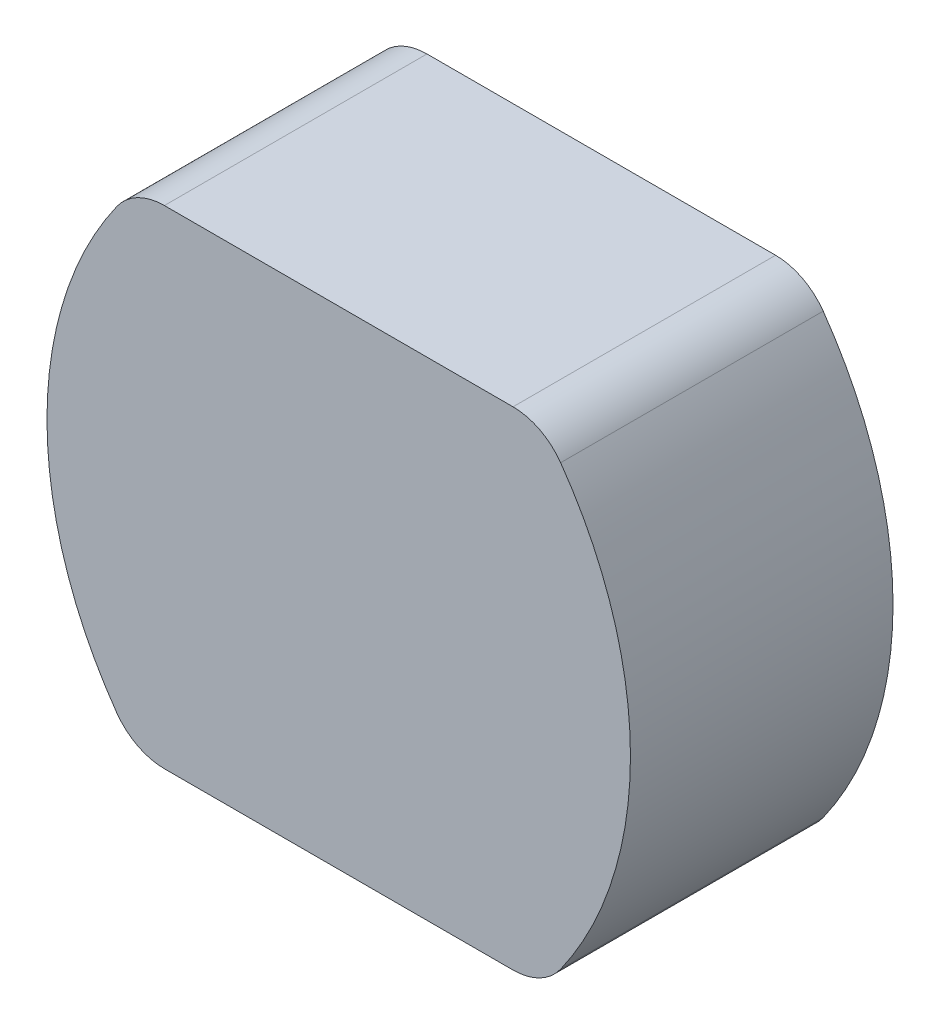
ISO-10303-21;
HEADER;
FILE_DESCRIPTION(('STEP AP214'),'2;1');
FILE_NAME('part.step','',(''),(''),'','','');
FILE_SCHEMA(('AUTOMOTIVE_DESIGN { 1 0 10303 214 1 1 1 1 }'));
ENDSEC;
DATA;
#1=APPLICATION_CONTEXT('core data for automotive mechanical design processes');
#2=APPLICATION_PROTOCOL_DEFINITION('international standard','automotive_design',2000,#1);
#3=PRODUCT_CONTEXT('',#1,'mechanical');
#4=PRODUCT('Part','Part','',(#3));
#5=PRODUCT_RELATED_PRODUCT_CATEGORY('part','',(#4));
#6=PRODUCT_DEFINITION_FORMATION('','',#4);
#7=PRODUCT_DEFINITION_CONTEXT('part definition',#1,'design');
#8=PRODUCT_DEFINITION('design','',#6,#7);
#9=PRODUCT_DEFINITION_SHAPE('','',#8);
#10=(LENGTH_UNIT() NAMED_UNIT(*) SI_UNIT(.MILLI.,.METRE.));
#11=(NAMED_UNIT(*) PLANE_ANGLE_UNIT() SI_UNIT($,.RADIAN.));
#12=(NAMED_UNIT(*) SI_UNIT($,.STERADIAN.) SOLID_ANGLE_UNIT());
#13=UNCERTAINTY_MEASURE_WITH_UNIT(LENGTH_MEASURE(1.E-05),#10,'distance_accuracy_value','');
#14=(GEOMETRIC_REPRESENTATION_CONTEXT(3) GLOBAL_UNCERTAINTY_ASSIGNED_CONTEXT((#13)) GLOBAL_UNIT_ASSIGNED_CONTEXT((#10,
#11,#12)) REPRESENTATION_CONTEXT('',''));
#15=CARTESIAN_POINT('',(0.,0.,0.));
#16=DIRECTION('',(0.,0.,1.));
#17=DIRECTION('',(1.,0.,0.));
#18=AXIS2_PLACEMENT_3D('',#15,#16,#17);
#19=CARTESIAN_POINT('',(3.,0.,9.));
#20=DIRECTION('',(0.,0.,-1.));
#21=DIRECTION('',(-1.,0.,0.));
#22=AXIS2_PLACEMENT_3D('',#19,#20,#21);
#23=CYLINDRICAL_SURFACE('',#22,13.);
#24=CARTESIAN_POINT('',(3.,0.,0.));
#25=DIRECTION('',(0.,0.,1.));
#26=DIRECTION('',(1.,0.,0.));
#27=AXIS2_PLACEMENT_3D('',#24,#25,#26);
#28=CIRCLE('',#27,13.);
#29=CARTESIAN_POINT('',(-7.6068033679309,-7.51636363636364,0.));
#30=VERTEX_POINT('',#29);
#31=CARTESIAN_POINT('',(-7.60680336793091,7.51636363636363,0.));
#32=VERTEX_POINT('',#31);
#33=EDGE_CURVE('E106',#30,#32,#28,.F.);
#34=ORIENTED_EDGE('',*,*,#33,.F.);
#35=DIRECTION('',(0.,0.,-1.));
#36=VECTOR('',#35,1.);
#37=CARTESIAN_POINT('',(-7.6068033679309,-7.51636363636364,9.));
#38=LINE('',#37,#36);
#39=CARTESIAN_POINT('',(-7.6068033679309,-7.51636363636364,9.));
#40=VERTEX_POINT('',#39);
#41=EDGE_CURVE('E56',#30,#40,#38,.F.);
#42=ORIENTED_EDGE('',*,*,#41,.T.);
#43=CARTESIAN_POINT('',(3.,0.,9.));
#44=DIRECTION('',(0.,0.,1.));
#45=DIRECTION('',(1.,0.,0.));
#46=AXIS2_PLACEMENT_3D('',#43,#44,#45);
#47=CIRCLE('',#46,13.);
#48=CARTESIAN_POINT('',(-7.60680336793091,7.51636363636363,9.));
#49=VERTEX_POINT('',#48);
#50=EDGE_CURVE('E121',#40,#49,#47,.F.);
#51=ORIENTED_EDGE('',*,*,#50,.T.);
#52=DIRECTION('',(0.,0.,-1.));
#53=VECTOR('',#52,1.);
#54=CARTESIAN_POINT('',(-7.60680336793091,7.51636363636363,9.));
#55=LINE('',#54,#53);
#56=EDGE_CURVE('E142',#49,#32,#55,.T.);
#57=ORIENTED_EDGE('',*,*,#56,.T.);
#58=EDGE_LOOP('',(#34,#42,#51,#57));
#59=FACE_BOUND('',#58,.T.);
#60=ADVANCED_FACE('F33',(#59),#23,.T.);
#61=CARTESIAN_POINT('',(0.,-8.36,9.));
#62=DIRECTION('',(0.,1.,0.));
#63=DIRECTION('',(-1.,0.,0.));
#64=AXIS2_PLACEMENT_3D('',#61,#62,#63);
#65=PLANE('',#64);
#66=DIRECTION('',(1.,0.,0.));
#67=VECTOR('',#66,1.);
#68=CARTESIAN_POINT('',(0.,-8.36,9.));
#69=LINE('',#68,#67);
#70=CARTESIAN_POINT('',(-5.9749874651723,-8.36,9.));
#71=VERTEX_POINT('',#70);
#72=CARTESIAN_POINT('',(5.97498746517231,-8.36,9.));
#73=VERTEX_POINT('',#72);
#74=EDGE_CURVE('E157',#71,#73,#69,.T.);
#75=ORIENTED_EDGE('',*,*,#74,.F.);
#76=DIRECTION('',(0.,0.,1.));
#77=VECTOR('',#76,1.);
#78=CARTESIAN_POINT('',(-5.9749874651723,-8.36,0.));
#79=LINE('',#78,#77);
#80=CARTESIAN_POINT('',(-5.9749874651723,-8.36,0.));
#81=VERTEX_POINT('',#80);
#82=EDGE_CURVE('E146',#71,#81,#79,.F.);
#83=ORIENTED_EDGE('',*,*,#82,.T.);
#84=DIRECTION('',(1.,0.,0.));
#85=VECTOR('',#84,1.);
#86=CARTESIAN_POINT('',(0.,-8.36,0.));
#87=LINE('',#86,#85);
#88=CARTESIAN_POINT('',(5.97498746517231,-8.36,0.));
#89=VERTEX_POINT('',#88);
#90=EDGE_CURVE('E166',#81,#89,#87,.T.);
#91=ORIENTED_EDGE('',*,*,#90,.T.);
#92=DIRECTION('',(0.,0.,-1.));
#93=VECTOR('',#92,1.);
#94=CARTESIAN_POINT('',(5.97498746517231,-8.36,9.));
#95=LINE('',#94,#93);
#96=EDGE_CURVE('E144',#89,#73,#95,.F.);
#97=ORIENTED_EDGE('',*,*,#96,.T.);
#98=EDGE_LOOP('',(#75,#83,#91,#97));
#99=FACE_BOUND('',#98,.T.);
#100=ADVANCED_FACE('F161',(#99),#65,.F.);
#101=CARTESIAN_POINT('',(-3.,0.,9.));
#102=DIRECTION('',(0.,0.,-1.));
#103=DIRECTION('',(-1.,0.,0.));
#104=AXIS2_PLACEMENT_3D('',#101,#102,#103);
#105=CYLINDRICAL_SURFACE('',#104,13.);
#106=CARTESIAN_POINT('',(-3.,0.,9.));
#107=DIRECTION('',(0.,0.,1.));
#108=DIRECTION('',(1.,0.,0.));
#109=AXIS2_PLACEMENT_3D('',#106,#107,#108);
#110=CIRCLE('',#109,13.);
#111=CARTESIAN_POINT('',(7.60680336793091,-7.51636363636364,9.));
#112=VERTEX_POINT('',#111);
#113=CARTESIAN_POINT('',(7.60680336793091,7.51636363636364,9.));
#114=VERTEX_POINT('',#113);
#115=EDGE_CURVE('E131',#112,#114,#110,.T.);
#116=ORIENTED_EDGE('',*,*,#115,.F.);
#117=DIRECTION('',(0.,0.,-1.));
#118=VECTOR('',#117,1.);
#119=CARTESIAN_POINT('',(7.60680336793091,-7.51636363636364,9.));
#120=LINE('',#119,#118);
#121=CARTESIAN_POINT('',(7.60680336793091,-7.51636363636364,0.));
#122=VERTEX_POINT('',#121);
#123=EDGE_CURVE('E11',#112,#122,#120,.T.);
#124=ORIENTED_EDGE('',*,*,#123,.T.);
#125=CARTESIAN_POINT('',(-3.,0.,0.));
#126=DIRECTION('',(0.,0.,1.));
#127=DIRECTION('',(1.,0.,0.));
#128=AXIS2_PLACEMENT_3D('',#125,#126,#127);
#129=CIRCLE('',#128,13.);
#130=CARTESIAN_POINT('',(7.60680336793091,7.51636363636364,0.));
#131=VERTEX_POINT('',#130);
#132=EDGE_CURVE('E122',#122,#131,#129,.T.);
#133=ORIENTED_EDGE('',*,*,#132,.T.);
#134=DIRECTION('',(0.,0.,-1.));
#135=VECTOR('',#134,1.);
#136=CARTESIAN_POINT('',(7.60680336793091,7.51636363636364,9.));
#137=LINE('',#136,#135);
#138=EDGE_CURVE('E136',#131,#114,#137,.F.);
#139=ORIENTED_EDGE('',*,*,#138,.T.);
#140=EDGE_LOOP('',(#116,#124,#133,#139));
#141=FACE_BOUND('',#140,.T.);
#142=ADVANCED_FACE('F172',(#141),#105,.T.);
#143=CARTESIAN_POINT('',(0.,8.36,9.));
#144=DIRECTION('',(0.,1.,0.));
#145=DIRECTION('',(-1.,0.,0.));
#146=AXIS2_PLACEMENT_3D('',#143,#144,#145);
#147=PLANE('',#146);
#148=DIRECTION('',(1.,0.,0.));
#149=VECTOR('',#148,1.);
#150=CARTESIAN_POINT('',(0.,8.36,9.));
#151=LINE('',#150,#149);
#152=CARTESIAN_POINT('',(-5.97498746517231,8.36,9.));
#153=VERTEX_POINT('',#152);
#154=CARTESIAN_POINT('',(5.97498746517231,8.36,9.));
#155=VERTEX_POINT('',#154);
#156=EDGE_CURVE('E128',#153,#155,#151,.T.);
#157=ORIENTED_EDGE('',*,*,#156,.T.);
#158=DIRECTION('',(0.,0.,1.));
#159=VECTOR('',#158,1.);
#160=CARTESIAN_POINT('',(5.97498746517231,8.36,0.));
#161=LINE('',#160,#159);
#162=CARTESIAN_POINT('',(5.97498746517231,8.36,0.));
#163=VERTEX_POINT('',#162);
#164=EDGE_CURVE('E112',#155,#163,#161,.F.);
#165=ORIENTED_EDGE('',*,*,#164,.T.);
#166=DIRECTION('',(1.,0.,0.));
#167=VECTOR('',#166,1.);
#168=CARTESIAN_POINT('',(0.,8.36,0.));
#169=LINE('',#168,#167);
#170=CARTESIAN_POINT('',(-5.97498746517231,8.36,0.));
#171=VERTEX_POINT('',#170);
#172=EDGE_CURVE('E105',#171,#163,#169,.T.);
#173=ORIENTED_EDGE('',*,*,#172,.F.);
#174=DIRECTION('',(0.,0.,-1.));
#175=VECTOR('',#174,1.);
#176=CARTESIAN_POINT('',(-5.97498746517231,8.36,9.));
#177=LINE('',#176,#175);
#178=EDGE_CURVE('E118',#171,#153,#177,.F.);
#179=ORIENTED_EDGE('',*,*,#178,.T.);
#180=EDGE_LOOP('',(#157,#165,#173,#179));
#181=FACE_BOUND('',#180,.T.);
#182=ADVANCED_FACE('F117',(#181),#147,.T.);
#183=CARTESIAN_POINT('',(0.,0.,9.));
#184=DIRECTION('',(0.,0.,1.));
#185=DIRECTION('',(1.,0.,0.));
#186=AXIS2_PLACEMENT_3D('',#183,#184,#185);
#187=PLANE('',#186);
#188=ORIENTED_EDGE('',*,*,#50,.F.);
#189=CARTESIAN_POINT('',(-5.9749874651723,-6.36,9.));
#190=DIRECTION('',(0.,0.,1.));
#191=DIRECTION('',(1.,0.,0.));
#192=AXIS2_PLACEMENT_3D('',#189,#190,#191);
#193=CIRCLE('',#192,2.);
#194=EDGE_CURVE('E41',#40,#71,#193,.T.);
#195=ORIENTED_EDGE('',*,*,#194,.T.);
#196=ORIENTED_EDGE('',*,*,#74,.T.);
#197=CARTESIAN_POINT('',(5.97498746517231,-6.36,9.));
#198=DIRECTION('',(0.,0.,1.));
#199=DIRECTION('',(1.,0.,0.));
#200=AXIS2_PLACEMENT_3D('',#197,#198,#199);
#201=CIRCLE('',#200,2.);
#202=EDGE_CURVE('E48',#73,#112,#201,.T.);
#203=ORIENTED_EDGE('',*,*,#202,.T.);
#204=ORIENTED_EDGE('',*,*,#115,.T.);
#205=CARTESIAN_POINT('',(5.97498746517231,6.36,9.));
#206=DIRECTION('',(0.,0.,1.));
#207=DIRECTION('',(1.,0.,0.));
#208=AXIS2_PLACEMENT_3D('',#205,#206,#207);
#209=CIRCLE('',#208,2.);
#210=EDGE_CURVE('E140',#114,#155,#209,.T.);
#211=ORIENTED_EDGE('',*,*,#210,.T.);
#212=ORIENTED_EDGE('',*,*,#156,.F.);
#213=CARTESIAN_POINT('',(-5.97498746517231,6.36,9.));
#214=DIRECTION('',(0.,0.,1.));
#215=DIRECTION('',(1.,0.,0.));
#216=AXIS2_PLACEMENT_3D('',#213,#214,#215);
#217=CIRCLE('',#216,2.);
#218=EDGE_CURVE('E127',#153,#49,#217,.T.);
#219=ORIENTED_EDGE('',*,*,#218,.T.);
#220=EDGE_LOOP('',(#188,#195,#196,#203,#204,#211,#212,#219));
#221=FACE_BOUND('',#220,.T.);
#222=ADVANCED_FACE('F156',(#221),#187,.T.);
#223=CARTESIAN_POINT('',(0.,0.,0.));
#224=DIRECTION('',(0.,0.,1.));
#225=DIRECTION('',(1.,0.,0.));
#226=AXIS2_PLACEMENT_3D('',#223,#224,#225);
#227=PLANE('',#226);
#228=ORIENTED_EDGE('',*,*,#90,.F.);
#229=CARTESIAN_POINT('',(-5.9749874651723,-6.36,0.));
#230=DIRECTION('',(0.,0.,1.));
#231=DIRECTION('',(1.,0.,0.));
#232=AXIS2_PLACEMENT_3D('',#229,#230,#231);
#233=CIRCLE('',#232,2.);
#234=EDGE_CURVE('E151',#81,#30,#233,.F.);
#235=ORIENTED_EDGE('',*,*,#234,.T.);
#236=ORIENTED_EDGE('',*,*,#33,.T.);
#237=CARTESIAN_POINT('',(-5.97498746517231,6.36,0.));
#238=DIRECTION('',(0.,0.,1.));
#239=DIRECTION('',(1.,0.,0.));
#240=AXIS2_PLACEMENT_3D('',#237,#238,#239);
#241=CIRCLE('',#240,2.);
#242=EDGE_CURVE('E100',#32,#171,#241,.F.);
#243=ORIENTED_EDGE('',*,*,#242,.T.);
#244=ORIENTED_EDGE('',*,*,#172,.T.);
#245=CARTESIAN_POINT('',(5.97498746517231,6.36,0.));
#246=DIRECTION('',(0.,0.,1.));
#247=DIRECTION('',(1.,0.,0.));
#248=AXIS2_PLACEMENT_3D('',#245,#246,#247);
#249=CIRCLE('',#248,2.);
#250=EDGE_CURVE('E111',#163,#131,#249,.F.);
#251=ORIENTED_EDGE('',*,*,#250,.T.);
#252=ORIENTED_EDGE('',*,*,#132,.F.);
#253=CARTESIAN_POINT('',(5.97498746517231,-6.36,0.));
#254=DIRECTION('',(0.,0.,1.));
#255=DIRECTION('',(1.,0.,0.));
#256=AXIS2_PLACEMENT_3D('',#253,#254,#255);
#257=CIRCLE('',#256,2.);
#258=EDGE_CURVE('E149',#122,#89,#257,.F.);
#259=ORIENTED_EDGE('',*,*,#258,.T.);
#260=EDGE_LOOP('',(#228,#235,#236,#243,#244,#251,#252,#259));
#261=FACE_BOUND('',#260,.T.);
#262=ADVANCED_FACE('F103',(#261),#227,.F.);
#263=CARTESIAN_POINT('',(5.97498746517231,6.36,9.));
#264=DIRECTION('',(0.,0.,-1.));
#265=DIRECTION('',(-1.,0.,0.));
#266=AXIS2_PLACEMENT_3D('',#263,#264,#265);
#267=CYLINDRICAL_SURFACE('',#266,2.);
#268=ORIENTED_EDGE('',*,*,#210,.F.);
#269=ORIENTED_EDGE('',*,*,#138,.F.);
#270=ORIENTED_EDGE('',*,*,#250,.F.);
#271=ORIENTED_EDGE('',*,*,#164,.F.);
#272=EDGE_LOOP('',(#268,#269,#270,#271));
#273=FACE_BOUND('',#272,.T.);
#274=ADVANCED_FACE('F177',(#273),#267,.T.);
#275=CARTESIAN_POINT('',(-5.97498746517231,6.36,9.));
#276=DIRECTION('',(0.,0.,-1.));
#277=DIRECTION('',(-1.,0.,0.));
#278=AXIS2_PLACEMENT_3D('',#275,#276,#277);
#279=CYLINDRICAL_SURFACE('',#278,2.);
#280=ORIENTED_EDGE('',*,*,#218,.F.);
#281=ORIENTED_EDGE('',*,*,#178,.F.);
#282=ORIENTED_EDGE('',*,*,#242,.F.);
#283=ORIENTED_EDGE('',*,*,#56,.F.);
#284=EDGE_LOOP('',(#280,#281,#282,#283));
#285=FACE_BOUND('',#284,.T.);
#286=ADVANCED_FACE('F125',(#285),#279,.T.);
#287=CARTESIAN_POINT('',(-5.9749874651723,-6.36,9.));
#288=DIRECTION('',(0.,0.,-1.));
#289=DIRECTION('',(-1.,0.,0.));
#290=AXIS2_PLACEMENT_3D('',#287,#288,#289);
#291=CYLINDRICAL_SURFACE('',#290,2.);
#292=ORIENTED_EDGE('',*,*,#194,.F.);
#293=ORIENTED_EDGE('',*,*,#41,.F.);
#294=ORIENTED_EDGE('',*,*,#234,.F.);
#295=ORIENTED_EDGE('',*,*,#82,.F.);
#296=EDGE_LOOP('',(#292,#293,#294,#295));
#297=FACE_BOUND('',#296,.T.);
#298=ADVANCED_FACE('F165',(#297),#291,.T.);
#299=CARTESIAN_POINT('',(5.97498746517231,-6.36,9.));
#300=DIRECTION('',(0.,0.,-1.));
#301=DIRECTION('',(-1.,0.,0.));
#302=AXIS2_PLACEMENT_3D('',#299,#300,#301);
#303=CYLINDRICAL_SURFACE('',#302,2.);
#304=ORIENTED_EDGE('',*,*,#202,.F.);
#305=ORIENTED_EDGE('',*,*,#96,.F.);
#306=ORIENTED_EDGE('',*,*,#258,.F.);
#307=ORIENTED_EDGE('',*,*,#123,.F.);
#308=EDGE_LOOP('',(#304,#305,#306,#307));
#309=FACE_BOUND('',#308,.T.);
#310=ADVANCED_FACE('F35',(#309),#303,.T.);
#311=CLOSED_SHELL('',(#60,#100,#142,#182,#222,#262,#274,#286,#298,#310));
#312=MANIFOLD_SOLID_BREP('B2',#311);
#313=ADVANCED_BREP_SHAPE_REPRESENTATION('',(#18,#312),#14);
#314=SHAPE_DEFINITION_REPRESENTATION(#9,#313);
ENDSEC;
END-ISO-10303-21;
